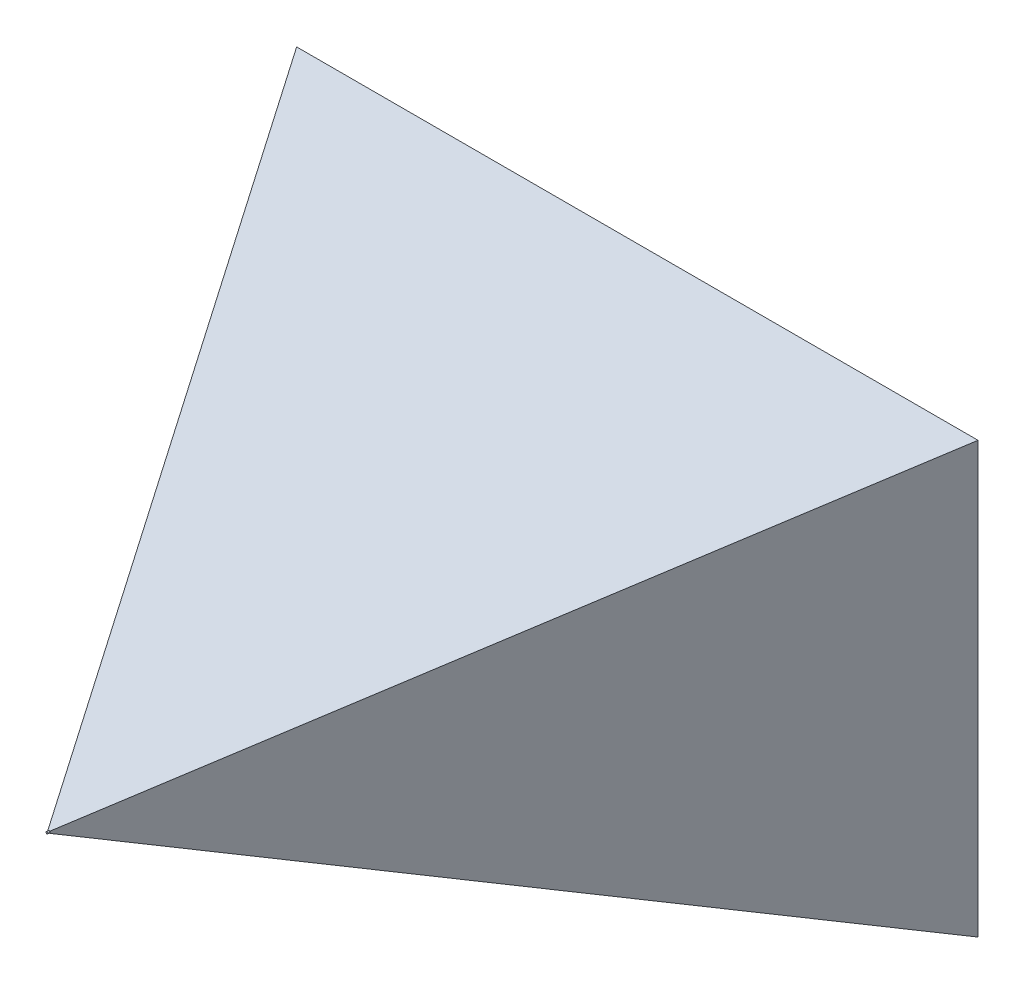
ISO-10303-21;
HEADER;
FILE_DESCRIPTION(('STEP AP214'),'2;1');
FILE_NAME('part.step','',(''),(''),'','','');
FILE_SCHEMA(('AUTOMOTIVE_DESIGN { 1 0 10303 214 1 1 1 1 }'));
ENDSEC;
DATA;
#1=APPLICATION_CONTEXT('core data for automotive mechanical design processes');
#2=APPLICATION_PROTOCOL_DEFINITION('international standard','automotive_design',2000,#1);
#3=PRODUCT_CONTEXT('',#1,'mechanical');
#4=PRODUCT('Part','Part','',(#3));
#5=PRODUCT_RELATED_PRODUCT_CATEGORY('part','',(#4));
#6=PRODUCT_DEFINITION_FORMATION('','',#4);
#7=PRODUCT_DEFINITION_CONTEXT('part definition',#1,'design');
#8=PRODUCT_DEFINITION('design','',#6,#7);
#9=PRODUCT_DEFINITION_SHAPE('','',#8);
#10=(LENGTH_UNIT() NAMED_UNIT(*) SI_UNIT(.MILLI.,.METRE.));
#11=(NAMED_UNIT(*) PLANE_ANGLE_UNIT() SI_UNIT($,.RADIAN.));
#12=(NAMED_UNIT(*) SI_UNIT($,.STERADIAN.) SOLID_ANGLE_UNIT());
#13=UNCERTAINTY_MEASURE_WITH_UNIT(LENGTH_MEASURE(1.E-05),#10,'distance_accuracy_value','');
#14=(GEOMETRIC_REPRESENTATION_CONTEXT(3) GLOBAL_UNCERTAINTY_ASSIGNED_CONTEXT((#13)) GLOBAL_UNIT_ASSIGNED_CONTEXT((#10,
#11,#12)) REPRESENTATION_CONTEXT('',''));
#15=CARTESIAN_POINT('',(0.,0.,0.));
#16=DIRECTION('',(0.,0.,1.));
#17=DIRECTION('',(1.,0.,0.));
#18=AXIS2_PLACEMENT_3D('',#15,#16,#17);
#19=CARTESIAN_POINT('',(0.,0.,600.));
#20=DIRECTION('',(0.,0.,-1.));
#21=DIRECTION('',(-1.,0.,0.));
#22=AXIS2_PLACEMENT_3D('',#19,#20,#21);
#23=PLANE('',#22);
#24=CARTESIAN_POINT('',(400.,400.,600.));
#25=DIRECTION('',(0.,0.,1.));
#26=DIRECTION('',(1.,0.,0.));
#27=AXIS2_PLACEMENT_3D('',#24,#25,#26);
#28=CIRCLE('',#27,1.00000000000005);
#29=CARTESIAN_POINT('',(401.,400.,600.));
#30=VERTEX_POINT('',#29);
#31=CARTESIAN_POINT('',(400.,401.,600.));
#32=VERTEX_POINT('',#31);
#33=EDGE_CURVE('E46',#30,#32,#28,.T.);
#34=ORIENTED_EDGE('',*,*,#33,.F.);
#35=DIRECTION('',(0.,-1.,0.));
#36=VECTOR('',#35,1.);
#37=CARTESIAN_POINT('',(401.,619.382140559717,600.));
#38=LINE('',#37,#36);
#39=CARTESIAN_POINT('',(401.,401.,600.));
#40=VERTEX_POINT('',#39);
#41=EDGE_CURVE('E91',#40,#30,#38,.T.);
#42=ORIENTED_EDGE('',*,*,#41,.F.);
#43=DIRECTION('',(1.,0.,0.));
#44=VECTOR('',#43,1.);
#45=CARTESIAN_POINT('',(0.,401.,600.));
#46=LINE('',#45,#44);
#47=EDGE_CURVE('E110',#32,#40,#46,.T.);
#48=ORIENTED_EDGE('',*,*,#47,.F.);
#49=EDGE_LOOP('',(#34,#42,#48));
#50=FACE_BOUND('',#49,.T.);
#51=ADVANCED_FACE('F35',(#50),#23,.F.);
#52=CARTESIAN_POINT('',(399.,400.,600.));
#53=VERTEX_POINT('',#52);
#54=EDGE_CURVE('E11',#32,#53,#28,.T.);
#55=ORIENTED_EDGE('',*,*,#54,.F.);
#56=CARTESIAN_POINT('',(399.,401.,600.));
#57=VERTEX_POINT('',#56);
#58=EDGE_CURVE('E128',#57,#32,#46,.T.);
#59=ORIENTED_EDGE('',*,*,#58,.F.);
#60=DIRECTION('',(0.,-1.,0.));
#61=VECTOR('',#60,1.);
#62=CARTESIAN_POINT('',(399.,619.382140559717,600.));
#63=LINE('',#62,#61);
#64=EDGE_CURVE('E108',#57,#53,#63,.T.);
#65=ORIENTED_EDGE('',*,*,#64,.T.);
#66=EDGE_LOOP('',(#55,#59,#65));
#67=FACE_BOUND('',#66,.T.);
#68=ADVANCED_FACE('F143',(#67),#23,.F.);
#69=CARTESIAN_POINT('',(400.,399.,600.));
#70=VERTEX_POINT('',#69);
#71=EDGE_CURVE('E44',#53,#70,#28,.T.);
#72=ORIENTED_EDGE('',*,*,#71,.F.);
#73=CARTESIAN_POINT('',(399.,399.,600.));
#74=VERTEX_POINT('',#73);
#75=EDGE_CURVE('E119',#53,#74,#63,.T.);
#76=ORIENTED_EDGE('',*,*,#75,.T.);
#77=DIRECTION('',(1.,0.,0.));
#78=VECTOR('',#77,1.);
#79=CARTESIAN_POINT('',(0.,399.,600.));
#80=LINE('',#79,#78);
#81=EDGE_CURVE('E131',#74,#70,#80,.T.);
#82=ORIENTED_EDGE('',*,*,#81,.T.);
#83=EDGE_LOOP('',(#72,#76,#82));
#84=FACE_BOUND('',#83,.T.);
#85=ADVANCED_FACE('F164',(#84),#23,.F.);
#86=EDGE_CURVE('E104',#70,#30,#28,.T.);
#87=ORIENTED_EDGE('',*,*,#86,.F.);
#88=CARTESIAN_POINT('',(401.,399.,600.));
#89=VERTEX_POINT('',#88);
#90=EDGE_CURVE('E106',#70,#89,#80,.T.);
#91=ORIENTED_EDGE('',*,*,#90,.T.);
#92=EDGE_CURVE('E94',#30,#89,#38,.T.);
#93=ORIENTED_EDGE('',*,*,#92,.F.);
#94=EDGE_LOOP('',(#87,#91,#93));
#95=FACE_BOUND('',#94,.T.);
#96=ADVANCED_FACE('F102',(#95),#23,.F.);
#97=CARTESIAN_POINT('',(0.,0.,0.));
#98=DIRECTION('',(0.,0.,-1.));
#99=DIRECTION('',(-1.,0.,0.));
#100=AXIS2_PLACEMENT_3D('',#97,#98,#99);
#101=PLANE('',#100);
#102=DIRECTION('',(0.,1.,0.));
#103=VECTOR('',#102,1.);
#104=CARTESIAN_POINT('',(747.410161513771,0.,0.));
#105=LINE('',#104,#103);
#106=CARTESIAN_POINT('',(747.410161513771,180.617859440283,0.));
#107=VERTEX_POINT('',#106);
#108=CARTESIAN_POINT('',(747.410161513771,619.382140559717,0.));
#109=VERTEX_POINT('',#108);
#110=EDGE_CURVE('E124',#107,#109,#105,.T.);
#111=ORIENTED_EDGE('',*,*,#110,.F.);
#112=DIRECTION('',(1.,0.,0.));
#113=VECTOR('',#112,1.);
#114=CARTESIAN_POINT('',(0.,180.617859440283,0.));
#115=LINE('',#114,#113);
#116=CARTESIAN_POINT('',(52.5898384862295,180.617859440283,0.));
#117=VERTEX_POINT('',#116);
#118=EDGE_CURVE('E130',#117,#107,#115,.T.);
#119=ORIENTED_EDGE('',*,*,#118,.F.);
#120=DIRECTION('',(0.,-1.,0.));
#121=VECTOR('',#120,1.);
#122=CARTESIAN_POINT('',(52.5898384862295,0.,0.));
#123=LINE('',#122,#121);
#124=CARTESIAN_POINT('',(52.5898384862295,619.382140559717,0.));
#125=VERTEX_POINT('',#124);
#126=EDGE_CURVE('E99',#125,#117,#123,.T.);
#127=ORIENTED_EDGE('',*,*,#126,.F.);
#128=DIRECTION('',(-1.,0.,0.));
#129=VECTOR('',#128,1.);
#130=CARTESIAN_POINT('',(0.,619.382140559717,0.));
#131=LINE('',#130,#129);
#132=EDGE_CURVE('E135',#109,#125,#131,.T.);
#133=ORIENTED_EDGE('',*,*,#132,.F.);
#134=EDGE_LOOP('',(#111,#119,#127,#133));
#135=FACE_BOUND('',#134,.T.);
#136=ADVANCED_FACE('F37',(#135),#101,.T.);
#137=CARTESIAN_POINT('',(0.,399.,600.));
#138=DIRECTION('',(0.,0.939692620785911,-0.342020143325662));
#139=DIRECTION('',(0.,0.342020143325662,0.939692620785911));
#140=AXIS2_PLACEMENT_3D('',#137,#138,#139);
#141=PLANE('',#140);
#142=ORIENTED_EDGE('',*,*,#118,.T.);
#143=DIRECTION('',(-0.47687096271147,0.300626578483217,0.82596473607056));
#144=VECTOR('',#143,1.);
#145=CARTESIAN_POINT('',(309.810228053977,456.487394445077,757.945318141133));
#146=LINE('',#145,#144);
#147=EDGE_CURVE('E126',#107,#89,#146,.T.);
#148=ORIENTED_EDGE('',*,*,#147,.T.);
#149=ORIENTED_EDGE('',*,*,#90,.F.);
#150=ORIENTED_EDGE('',*,*,#81,.F.);
#151=DIRECTION('',(-0.476870962711469,-0.300626578483217,-0.82596473607056));
#152=VECTOR('',#151,1.);
#153=CARTESIAN_POINT('',(308.265039884132,341.799325726719,442.842439056579));
#154=LINE('',#153,#152);
#155=EDGE_CURVE('E121',#74,#117,#154,.T.);
#156=ORIENTED_EDGE('',*,*,#155,.T.);
#157=EDGE_LOOP('',(#142,#148,#149,#150,#156));
#158=FACE_BOUND('',#157,.T.);
#159=ADVANCED_FACE('F171',(#158),#141,.F.);
#160=CARTESIAN_POINT('',(0.,401.,600.));
#161=DIRECTION('',(0.,-0.93969262078591,-0.342020143325663));
#162=DIRECTION('',(0.,0.342020143325663,-0.939692620785911));
#163=AXIS2_PLACEMENT_3D('',#160,#161,#162);
#164=PLANE('',#163);
#165=ORIENTED_EDGE('',*,*,#58,.T.);
#166=ORIENTED_EDGE('',*,*,#47,.T.);
#167=DIRECTION('',(0.47687096271147,0.300626578483218,-0.82596473607056));
#168=VECTOR('',#167,1.);
#169=CARTESIAN_POINT('',(309.810228053977,343.512605554923,757.945318141133));
#170=LINE('',#169,#168);
#171=EDGE_CURVE('E39',#40,#109,#170,.T.);
#172=ORIENTED_EDGE('',*,*,#171,.T.);
#173=ORIENTED_EDGE('',*,*,#132,.T.);
#174=DIRECTION('',(0.476870962711469,-0.300626578483218,0.82596473607056));
#175=VECTOR('',#174,1.);
#176=CARTESIAN_POINT('',(308.265039884132,458.200674273281,442.842439056579));
#177=LINE('',#176,#175);
#178=EDGE_CURVE('E115',#125,#57,#177,.T.);
#179=ORIENTED_EDGE('',*,*,#178,.T.);
#180=EDGE_LOOP('',(#165,#166,#172,#173,#179));
#181=FACE_BOUND('',#180,.T.);
#182=ADVANCED_FACE('F139',(#181),#164,.F.);
#183=CARTESIAN_POINT('',(0.,619.382140559717,-91.0882722199918));
#184=DIRECTION('',(0.866025403784442,0.,-0.499999999999995));
#185=DIRECTION('',(-0.499999999999995,0.,-0.866025403784442));
#186=AXIS2_PLACEMENT_3D('',#183,#184,#185);
#187=PLANE('',#186);
#188=ORIENTED_EDGE('',*,*,#64,.F.);
#189=ORIENTED_EDGE('',*,*,#178,.F.);
#190=ORIENTED_EDGE('',*,*,#126,.T.);
#191=ORIENTED_EDGE('',*,*,#155,.F.);
#192=ORIENTED_EDGE('',*,*,#75,.F.);
#193=EDGE_LOOP('',(#188,#189,#190,#191,#192));
#194=FACE_BOUND('',#193,.T.);
#195=ADVANCED_FACE('F144',(#194),#187,.F.);
#196=CARTESIAN_POINT('',(401.,619.382140559717,600.));
#197=DIRECTION('',(-0.866025403784442,0.,-0.499999999999995));
#198=DIRECTION('',(-0.499999999999995,0.,0.866025403784442));
#199=AXIS2_PLACEMENT_3D('',#196,#197,#198);
#200=PLANE('',#199);
#201=ORIENTED_EDGE('',*,*,#110,.T.);
#202=ORIENTED_EDGE('',*,*,#171,.F.);
#203=ORIENTED_EDGE('',*,*,#41,.T.);
#204=ORIENTED_EDGE('',*,*,#92,.T.);
#205=ORIENTED_EDGE('',*,*,#147,.F.);
#206=EDGE_LOOP('',(#201,#202,#203,#204,#205));
#207=FACE_BOUND('',#206,.T.);
#208=ADVANCED_FACE('F93',(#207),#200,.F.);
#209=CARTESIAN_POINT('',(400.,400.,602.));
#210=DIRECTION('',(0.,0.,-1.));
#211=DIRECTION('',(-1.,0.,0.));
#212=AXIS2_PLACEMENT_3D('',#209,#210,#211);
#213=CYLINDRICAL_SURFACE('',#212,1.00000000000005);
#214=CARTESIAN_POINT('',(400.,400.,602.));
#215=DIRECTION('',(0.,0.,1.));
#216=DIRECTION('',(1.,0.,0.));
#217=AXIS2_PLACEMENT_3D('',#214,#215,#216);
#218=CIRCLE('',#217,1.00000000000005);
#219=CARTESIAN_POINT('',(401.,400.,602.));
#220=VERTEX_POINT('',#219);
#221=EDGE_CURVE('E113',#220,#220,#218,.T.);
#222=ORIENTED_EDGE('',*,*,#221,.F.);
#223=EDGE_LOOP('',(#222));
#224=FACE_BOUND('',#223,.T.);
#225=ORIENTED_EDGE('',*,*,#33,.T.);
#226=ORIENTED_EDGE('',*,*,#54,.T.);
#227=ORIENTED_EDGE('',*,*,#71,.T.);
#228=ORIENTED_EDGE('',*,*,#86,.T.);
#229=EDGE_LOOP('',(#225,#226,#227,#228));
#230=FACE_BOUND('',#229,.T.);
#231=ADVANCED_FACE('F114',(#224,#230),#213,.T.);
#232=CARTESIAN_POINT('',(400.,400.,602.));
#233=DIRECTION('',(0.,0.,1.));
#234=DIRECTION('',(1.,0.,0.));
#235=AXIS2_PLACEMENT_3D('',#232,#233,#234);
#236=PLANE('',#235);
#237=ORIENTED_EDGE('',*,*,#221,.T.);
#238=EDGE_LOOP('',(#237));
#239=FACE_BOUND('',#238,.T.);
#240=ADVANCED_FACE('F150',(#239),#236,.T.);
#241=CLOSED_SHELL('',(#51,#68,#85,#96,#136,#159,#182,#195,#208,#231,#240));
#242=MANIFOLD_SOLID_BREP('B2',#241);
#243=ADVANCED_BREP_SHAPE_REPRESENTATION('',(#18,#242),#14);
#244=SHAPE_DEFINITION_REPRESENTATION(#9,#243);
ENDSEC;
END-ISO-10303-21;
